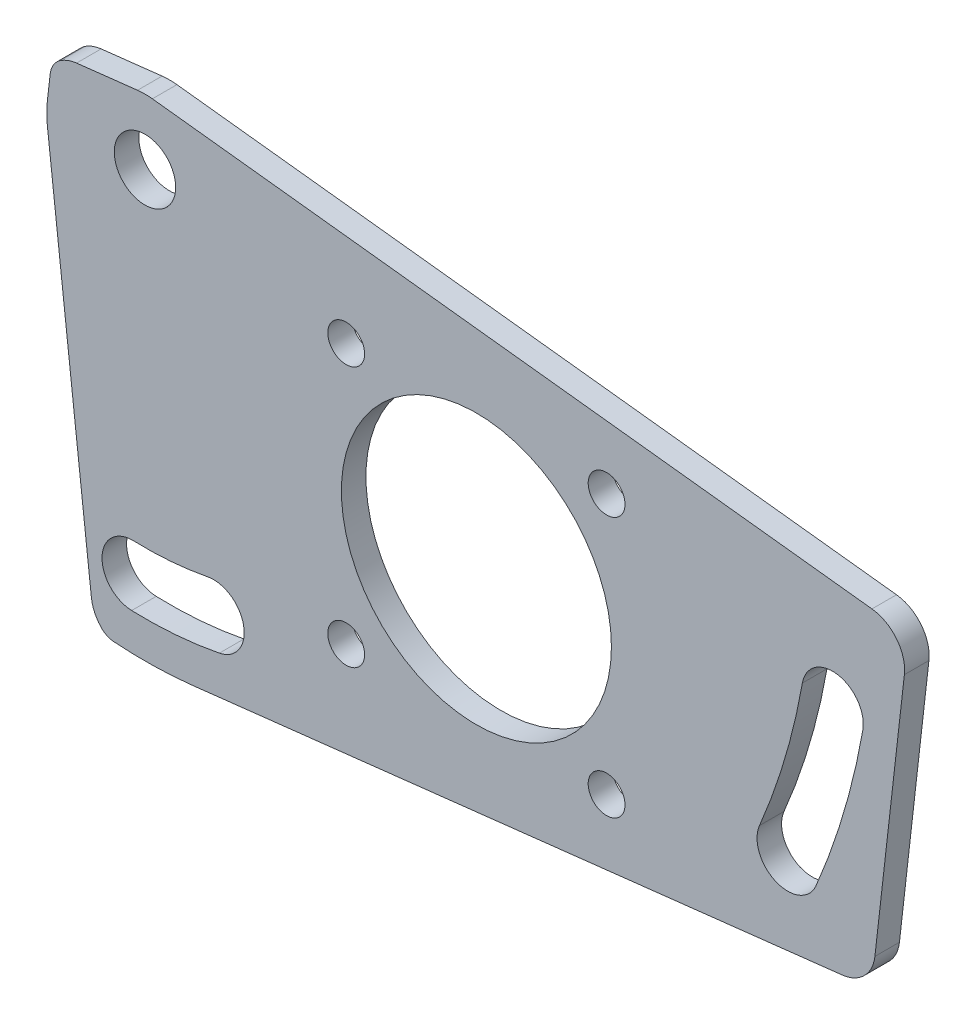
ISO-10303-21;
HEADER;
FILE_DESCRIPTION(('STEP AP214'),'2;1');
FILE_NAME('part.step','',(''),(''),'','','');
FILE_SCHEMA(('AUTOMOTIVE_DESIGN { 1 0 10303 214 1 1 1 1 }'));
ENDSEC;
DATA;
#1=APPLICATION_CONTEXT('core data for automotive mechanical design processes');
#2=APPLICATION_PROTOCOL_DEFINITION('international standard','automotive_design',2000,#1);
#3=PRODUCT_CONTEXT('',#1,'mechanical');
#4=PRODUCT('Part','Part','',(#3));
#5=PRODUCT_RELATED_PRODUCT_CATEGORY('part','',(#4));
#6=PRODUCT_DEFINITION_FORMATION('','',#4);
#7=PRODUCT_DEFINITION_CONTEXT('part definition',#1,'design');
#8=PRODUCT_DEFINITION('design','',#6,#7);
#9=PRODUCT_DEFINITION_SHAPE('','',#8);
#10=(LENGTH_UNIT() NAMED_UNIT(*) SI_UNIT(.MILLI.,.METRE.));
#11=(NAMED_UNIT(*) PLANE_ANGLE_UNIT() SI_UNIT($,.RADIAN.));
#12=(NAMED_UNIT(*) SI_UNIT($,.STERADIAN.) SOLID_ANGLE_UNIT());
#13=UNCERTAINTY_MEASURE_WITH_UNIT(LENGTH_MEASURE(1.E-05),#10,'distance_accuracy_value','');
#14=(GEOMETRIC_REPRESENTATION_CONTEXT(3) GLOBAL_UNCERTAINTY_ASSIGNED_CONTEXT((#13)) GLOBAL_UNIT_ASSIGNED_CONTEXT((#10,
#11,#12)) REPRESENTATION_CONTEXT('',''));
#15=CARTESIAN_POINT('',(0.,0.,0.));
#16=DIRECTION('',(0.,0.,1.));
#17=DIRECTION('',(1.,0.,0.));
#18=AXIS2_PLACEMENT_3D('',#15,#16,#17);
#19=CARTESIAN_POINT('',(-32.,-17.,2.));
#20=DIRECTION('',(0.,0.,-1.));
#21=DIRECTION('',(-1.,0.,0.));
#22=AXIS2_PLACEMENT_3D('',#19,#20,#21);
#23=PLANE('',#22);
#24=CARTESIAN_POINT('',(-10.6066017177982,-10.6066017177982,2.));
#25=DIRECTION('',(0.,0.,1.));
#26=DIRECTION('',(1.,0.,0.));
#27=AXIS2_PLACEMENT_3D('',#24,#25,#26);
#28=CIRCLE('',#27,1.5);
#29=CARTESIAN_POINT('',(-9.10660171779821,-10.6066017177982,2.));
#30=VERTEX_POINT('',#29);
#31=EDGE_CURVE('E327',#30,#30,#28,.T.);
#32=ORIENTED_EDGE('',*,*,#31,.F.);
#33=EDGE_LOOP('',(#32));
#34=FACE_BOUND('',#33,.T.);
#35=CARTESIAN_POINT('',(10.6066017177982,-10.6066017177982,2.));
#36=DIRECTION('',(0.,0.,1.));
#37=DIRECTION('',(1.,0.,0.));
#38=AXIS2_PLACEMENT_3D('',#35,#36,#37);
#39=CIRCLE('',#38,1.5);
#40=CARTESIAN_POINT('',(12.1066017177982,-10.6066017177982,2.));
#41=VERTEX_POINT('',#40);
#42=EDGE_CURVE('E321',#41,#41,#39,.T.);
#43=ORIENTED_EDGE('',*,*,#42,.F.);
#44=EDGE_LOOP('',(#43));
#45=FACE_BOUND('',#44,.T.);
#46=CARTESIAN_POINT('',(10.6066017177982,10.6066017177982,2.));
#47=DIRECTION('',(0.,0.,1.));
#48=DIRECTION('',(1.,0.,0.));
#49=AXIS2_PLACEMENT_3D('',#46,#47,#48);
#50=CIRCLE('',#49,1.5);
#51=CARTESIAN_POINT('',(12.1066017177982,10.6066017177982,2.));
#52=VERTEX_POINT('',#51);
#53=EDGE_CURVE('E314',#52,#52,#50,.T.);
#54=ORIENTED_EDGE('',*,*,#53,.F.);
#55=EDGE_LOOP('',(#54));
#56=FACE_BOUND('',#55,.T.);
#57=CARTESIAN_POINT('',(-10.6066017177982,10.6066017177982,2.));
#58=DIRECTION('',(0.,0.,1.));
#59=DIRECTION('',(1.,0.,0.));
#60=AXIS2_PLACEMENT_3D('',#57,#58,#59);
#61=CIRCLE('',#60,1.5);
#62=CARTESIAN_POINT('',(-9.10660171779822,10.6066017177982,2.));
#63=VERTEX_POINT('',#62);
#64=EDGE_CURVE('E332',#63,#63,#61,.T.);
#65=ORIENTED_EDGE('',*,*,#64,.F.);
#66=EDGE_LOOP('',(#65));
#67=FACE_BOUND('',#66,.T.);
#68=CARTESIAN_POINT('',(25.3610512395109,-7.55928093476605,2.));
#69=DIRECTION('',(0.,0.,1.));
#70=DIRECTION('',(1.,0.,0.));
#71=AXIS2_PLACEMENT_3D('',#68,#69,#70);
#72=CIRCLE('',#71,2.50000000000001);
#73=CARTESIAN_POINT('',(23.0597891058798,-6.58245311354288,2.));
#74=VERTEX_POINT('',#73);
#75=CARTESIAN_POINT('',(27.662313373142,-8.53610875598923,2.));
#76=VERTEX_POINT('',#75);
#77=EDGE_CURVE('E369',#74,#76,#72,.T.);
#78=ORIENTED_EDGE('',*,*,#77,.F.);
#79=CARTESIAN_POINT('',(-27.,14.6666666666667,2.));
#80=DIRECTION('',(0.,0.,-1.));
#81=DIRECTION('',(1.,0.,0.));
#82=AXIS2_PLACEMENT_3D('',#79,#80,#81);
#83=CIRCLE('',#82,54.382971385893);
#84=CARTESIAN_POINT('',(26.5567718526685,5.22316278939351,2.));
#85=VERTEX_POINT('',#84);
#86=EDGE_CURVE('E377',#85,#74,#83,.T.);
#87=ORIENTED_EDGE('',*,*,#86,.F.);
#88=CARTESIAN_POINT('',(29.018791235199,4.78904234522618,2.));
#89=DIRECTION('',(0.,0.,1.));
#90=DIRECTION('',(1.,0.,0.));
#91=AXIS2_PLACEMENT_3D('',#88,#89,#90);
#92=CIRCLE('',#91,2.50000000000001);
#93=CARTESIAN_POINT('',(31.4808106177295,4.35492190105882,2.));
#94=VERTEX_POINT('',#93);
#95=EDGE_CURVE('E374',#94,#85,#92,.T.);
#96=ORIENTED_EDGE('',*,*,#95,.F.);
#97=CARTESIAN_POINT('',(-27.,14.6666666666667,2.));
#98=DIRECTION('',(0.,0.,1.));
#99=DIRECTION('',(1.,0.,0.));
#100=AXIS2_PLACEMENT_3D('',#97,#98,#99);
#101=CIRCLE('',#100,59.382971385893);
#102=EDGE_CURVE('E371',#76,#94,#101,.T.);
#103=ORIENTED_EDGE('',*,*,#102,.F.);
#104=EDGE_LOOP('',(#78,#87,#96,#103));
#105=FACE_BOUND('',#104,.T.);
#106=DIRECTION('',(0.113203213767907,-0.993571855676587,0.));
#107=VECTOR('',#106,1.);
#108=CARTESIAN_POINT('',(-34.9485748454127,13.7610409565234,2.));
#109=LINE('',#108,#107);
#110=CARTESIAN_POINT('',(-34.9485748454127,13.7610409565234,2.));
#111=VERTEX_POINT('',#110);
#112=CARTESIAN_POINT('',(-31.363806409429,-17.7020678065685,2.));
#113=VERTEX_POINT('',#112);
#114=EDGE_CURVE('E210',#111,#113,#109,.T.);
#115=ORIENTED_EDGE('',*,*,#114,.T.);
#116=CARTESIAN_POINT('',(-28.3830908423992,-17.3624581652648,2.));
#117=DIRECTION('',(0.,0.,1.));
#118=DIRECTION('',(1.,0.,0.));
#119=AXIS2_PLACEMENT_3D('',#116,#117,#118);
#120=CIRCLE('',#119,3.);
#121=CARTESIAN_POINT('',(-30.5561611805625,-19.4307340911013,2.));
#122=VERTEX_POINT('',#121);
#123=EDGE_CURVE('E49',#113,#122,#120,.T.);
#124=ORIENTED_EDGE('',*,*,#123,.T.);
#125=CARTESIAN_POINT('',(-29.4380048173965,-18.3664998384669,2.));
#126=DIRECTION('',(0.,0.,1.));
#127=DIRECTION('',(1.,0.,0.));
#128=AXIS2_PLACEMENT_3D('',#125,#126,#127);
#129=CIRCLE('',#128,1.543654170133);
#130=CARTESIAN_POINT('',(-29.5516248060244,-19.9059668550519,2.));
#131=VERTEX_POINT('',#130);
#132=EDGE_CURVE('E201',#122,#131,#129,.T.);
#133=ORIENTED_EDGE('',*,*,#132,.T.);
#134=CARTESIAN_POINT('',(-27.,14.6666666666667,2.));
#135=DIRECTION('',(0.,0.,1.));
#136=DIRECTION('',(1.,0.,0.));
#137=AXIS2_PLACEMENT_3D('',#134,#135,#136);
#138=CIRCLE('',#137,34.6666666666667);
#139=CARTESIAN_POINT('',(-23.0756219227126,-19.777157663455,2.));
#140=VERTEX_POINT('',#139);
#141=EDGE_CURVE('E205',#131,#140,#138,.T.);
#142=ORIENTED_EDGE('',*,*,#141,.T.);
#143=DIRECTION('',(0.993571855676587,0.113203213767907,0.));
#144=VECTOR('',#143,1.);
#145=CARTESIAN_POINT('',(-23.0756219227126,-19.777157663455,2.));
#146=LINE('',#145,#144);
#147=CARTESIAN_POINT('',(29.8232528052238,-13.750092192855,2.));
#148=VERTEX_POINT('',#147);
#149=EDGE_CURVE('E217',#140,#148,#146,.T.);
#150=ORIENTED_EDGE('',*,*,#149,.T.);
#151=CARTESIAN_POINT('',(29.4836431639201,-10.7693766258253,2.));
#152=DIRECTION('',(0.,0.,1.));
#153=DIRECTION('',(1.,0.,0.));
#154=AXIS2_PLACEMENT_3D('',#151,#152,#153);
#155=CIRCLE('',#154,3.);
#156=CARTESIAN_POINT('',(32.4643587309499,-11.108986267129,2.));
#157=VERTEX_POINT('',#156);
#158=EDGE_CURVE('E220',#148,#157,#155,.T.);
#159=ORIENTED_EDGE('',*,*,#158,.T.);
#160=DIRECTION('',(0.113203213767907,0.993571855676587,0.));
#161=VECTOR('',#160,1.);
#162=CARTESIAN_POINT('',(32.4643587309499,-11.108986267129,2.));
#163=LINE('',#162,#161);
#164=CARTESIAN_POINT('',(34.8655958840735,9.96640174296845,2.));
#165=VERTEX_POINT('',#164);
#166=EDGE_CURVE('E223',#157,#165,#163,.T.);
#167=ORIENTED_EDGE('',*,*,#166,.T.);
#168=CARTESIAN_POINT('',(31.8848803170438,10.3060113842722,2.));
#169=DIRECTION('',(0.,0.,1.));
#170=DIRECTION('',(1.,0.,0.));
#171=AXIS2_PLACEMENT_3D('',#168,#169,#170);
#172=CIRCLE('',#171,3.);
#173=CARTESIAN_POINT('',(32.2244899583475,13.2867269513019,2.));
#174=VERTEX_POINT('',#173);
#175=EDGE_CURVE('E226',#165,#174,#172,.T.);
#176=ORIENTED_EDGE('',*,*,#175,.T.);
#177=DIRECTION('',(-0.993571855676587,0.113203213767907,0.));
#178=VECTOR('',#177,1.);
#179=CARTESIAN_POINT('',(32.2244899583475,13.2867269513019,2.));
#180=LINE('',#179,#178);
#181=CARTESIAN_POINT('',(-26.3962495265712,19.9657165636085,2.));
#182=VERTEX_POINT('',#181);
#183=EDGE_CURVE('E229',#174,#182,#180,.T.);
#184=ORIENTED_EDGE('',*,*,#183,.T.);
#185=CARTESIAN_POINT('',(-27.,14.6666666666667,2.));
#186=DIRECTION('',(0.,0.,1.));
#187=DIRECTION('',(1.,0.,0.));
#188=AXIS2_PLACEMENT_3D('',#185,#186,#187);
#189=CIRCLE('',#188,5.33333333333333);
#190=CARTESIAN_POINT('',(-27.6037504734288,19.9657165636085,2.));
#191=VERTEX_POINT('',#190);
#192=EDGE_CURVE('E232',#182,#191,#189,.T.);
#193=ORIENTED_EDGE('',*,*,#192,.T.);
#194=DIRECTION('',(-0.993571855676587,-0.113203213767909,0.));
#195=VECTOR('',#194,1.);
#196=CARTESIAN_POINT('',(-27.6037504734288,19.9657165636085,2.));
#197=LINE('',#196,#195);
#198=CARTESIAN_POINT('',(-32.5716097518118,19.3997004947689,2.));
#199=VERTEX_POINT('',#198);
#200=EDGE_CURVE('E235',#191,#199,#197,.T.);
#201=ORIENTED_EDGE('',*,*,#200,.T.);
#202=CARTESIAN_POINT('',(-32.2320001105081,16.4189849277392,2.));
#203=DIRECTION('',(0.,0.,1.));
#204=DIRECTION('',(1.,0.,0.));
#205=AXIS2_PLACEMENT_3D('',#202,#203,#204);
#206=CIRCLE('',#205,3.);
#207=CARTESIAN_POINT('',(-33.8698794125308,18.932419110686,2.));
#208=VERTEX_POINT('',#207);
#209=EDGE_CURVE('E238',#199,#208,#206,.T.);
#210=ORIENTED_EDGE('',*,*,#209,.T.);
#211=CARTESIAN_POINT('',(-32.8291820747344,17.3354001730336,2.));
#212=DIRECTION('',(0.,0.,1.));
#213=DIRECTION('',(1.,0.,0.));
#214=AXIS2_PLACEMENT_3D('',#211,#212,#213);
#215=CIRCLE('',#214,1.9061795393186);
#216=CARTESIAN_POINT('',(-34.7231084168679,17.5511858229031,2.));
#217=VERTEX_POINT('',#216);
#218=EDGE_CURVE('E241',#208,#217,#215,.T.);
#219=ORIENTED_EDGE('',*,*,#218,.T.);
#220=DIRECTION('',(-0.113203213767902,-0.993571855676588,0.));
#221=VECTOR('',#220,1.);
#222=CARTESIAN_POINT('',(-34.7231084168679,17.5511858229031,2.));
#223=LINE('',#222,#221);
#224=CARTESIAN_POINT('',(-34.9485748454127,15.5722923768099,2.));
#225=VERTEX_POINT('',#224);
#226=EDGE_CURVE('E244',#217,#225,#223,.T.);
#227=ORIENTED_EDGE('',*,*,#226,.T.);
#228=CARTESIAN_POINT('',(-27.,14.6666666666667,2.));
#229=DIRECTION('',(0.,0.,1.));
#230=DIRECTION('',(1.,0.,0.));
#231=AXIS2_PLACEMENT_3D('',#228,#229,#230);
#232=CIRCLE('',#231,8.);
#233=EDGE_CURVE('E247',#225,#111,#232,.T.);
#234=ORIENTED_EDGE('',*,*,#233,.T.);
#235=EDGE_LOOP('',(#115,#124,#133,#142,#150,#159,#167,#176,#184,#193,#201,#210,#219,#227,#234));
#236=FACE_BOUND('',#235,.T.);
#237=CARTESIAN_POINT('',(0.,0.,2.));
#238=DIRECTION('',(0.,0.,1.));
#239=DIRECTION('',(1.,0.,0.));
#240=AXIS2_PLACEMENT_3D('',#237,#238,#239);
#241=CIRCLE('',#240,11.);
#242=CARTESIAN_POINT('',(11.,0.,2.));
#243=VERTEX_POINT('',#242);
#244=EDGE_CURVE('E12',#243,#243,#241,.T.);
#245=ORIENTED_EDGE('',*,*,#244,.F.);
#246=EDGE_LOOP('',(#245));
#247=FACE_BOUND('',#246,.T.);
#248=CARTESIAN_POINT('',(-27.,14.6666666666667,2.));
#249=DIRECTION('',(0.,0.,1.));
#250=DIRECTION('',(1.,0.,0.));
#251=AXIS2_PLACEMENT_3D('',#248,#249,#250);
#252=CIRCLE('',#251,2.49999999999999);
#253=CARTESIAN_POINT('',(-24.5,14.6666666666667,2.));
#254=VERTEX_POINT('',#253);
#255=EDGE_CURVE('E400',#254,#254,#252,.T.);
#256=ORIENTED_EDGE('',*,*,#255,.F.);
#257=EDGE_LOOP('',(#256));
#258=FACE_BOUND('',#257,.T.);
#259=CARTESIAN_POINT('',(-28.,-14.482852101993,2.));
#260=DIRECTION('',(0.,0.,1.));
#261=DIRECTION('',(1.,0.,0.));
#262=AXIS2_PLACEMENT_3D('',#259,#260,#261);
#263=CIRCLE('',#262,2.5);
#264=CARTESIAN_POINT('',(-27.9142857142857,-11.9843219218222,2.));
#265=VERTEX_POINT('',#264);
#266=CARTESIAN_POINT('',(-28.0857142857143,-16.9813822821639,2.));
#267=VERTEX_POINT('',#266);
#268=EDGE_CURVE('E338',#265,#267,#263,.T.);
#269=ORIENTED_EDGE('',*,*,#268,.F.);
#270=CARTESIAN_POINT('',(-27.,14.6666666666667,2.));
#271=DIRECTION('',(0.,0.,-1.));
#272=DIRECTION('',(1.,0.,0.));
#273=AXIS2_PLACEMENT_3D('',#270,#271,#272);
#274=CIRCLE('',#273,26.6666666666667);
#275=CARTESIAN_POINT('',(-21.8956846483741,-11.5069283462899,2.));
#276=VERTEX_POINT('',#275);
#277=EDGE_CURVE('E346',#276,#265,#274,.T.);
#278=ORIENTED_EDGE('',*,*,#277,.F.);
#279=CARTESIAN_POINT('',(-21.4171550841591,-13.9607028787546,2.));
#280=DIRECTION('',(0.,0.,1.));
#281=DIRECTION('',(1.,0.,0.));
#282=AXIS2_PLACEMENT_3D('',#279,#280,#281);
#283=CIRCLE('',#282,2.5);
#284=CARTESIAN_POINT('',(-20.9386255199442,-16.4144774112193,2.));
#285=VERTEX_POINT('',#284);
#286=EDGE_CURVE('E343',#285,#276,#283,.T.);
#287=ORIENTED_EDGE('',*,*,#286,.F.);
#288=CARTESIAN_POINT('',(-27.,14.6666666666667,2.));
#289=DIRECTION('',(0.,0.,1.));
#290=DIRECTION('',(1.,0.,0.));
#291=AXIS2_PLACEMENT_3D('',#288,#289,#290);
#292=CIRCLE('',#291,31.6666666666667);
#293=EDGE_CURVE('E340',#267,#285,#292,.T.);
#294=ORIENTED_EDGE('',*,*,#293,.F.);
#295=EDGE_LOOP('',(#269,#278,#287,#294));
#296=FACE_BOUND('',#295,.T.);
#297=ADVANCED_FACE('F34',(#34,#45,#56,#67,#105,#236,#247,#258,#296),#23,.F.);
#298=CARTESIAN_POINT('',(-32.,-17.,0.));
#299=DIRECTION('',(0.,0.,-1.));
#300=DIRECTION('',(-1.,0.,0.));
#301=AXIS2_PLACEMENT_3D('',#298,#299,#300);
#302=PLANE('',#301);
#303=CARTESIAN_POINT('',(-28.3830908423992,-17.3624581652648,0.));
#304=DIRECTION('',(0.,0.,1.));
#305=DIRECTION('',(1.,0.,0.));
#306=AXIS2_PLACEMENT_3D('',#303,#304,#305);
#307=CIRCLE('',#306,3.);
#308=CARTESIAN_POINT('',(-31.363806409429,-17.7020678065685,0.));
#309=VERTEX_POINT('',#308);
#310=CARTESIAN_POINT('',(-30.5561611805625,-19.4307340911013,0.));
#311=VERTEX_POINT('',#310);
#312=EDGE_CURVE('E192',#309,#311,#307,.T.);
#313=ORIENTED_EDGE('',*,*,#312,.F.);
#314=DIRECTION('',(0.113203213767907,-0.993571855676587,0.));
#315=VECTOR('',#314,1.);
#316=CARTESIAN_POINT('',(-34.9485748454127,13.7610409565234,0.));
#317=LINE('',#316,#315);
#318=CARTESIAN_POINT('',(-34.9485748454127,13.7610409565234,0.));
#319=VERTEX_POINT('',#318);
#320=EDGE_CURVE('E211',#319,#309,#317,.T.);
#321=ORIENTED_EDGE('',*,*,#320,.F.);
#322=CARTESIAN_POINT('',(-27.,14.6666666666667,0.));
#323=DIRECTION('',(0.,0.,1.));
#324=DIRECTION('',(1.,0.,0.));
#325=AXIS2_PLACEMENT_3D('',#322,#323,#324);
#326=CIRCLE('',#325,8.);
#327=CARTESIAN_POINT('',(-34.9485748454127,15.5722923768099,0.));
#328=VERTEX_POINT('',#327);
#329=EDGE_CURVE('E213',#328,#319,#326,.T.);
#330=ORIENTED_EDGE('',*,*,#329,.F.);
#331=DIRECTION('',(-0.113203213767902,-0.993571855676588,0.));
#332=VECTOR('',#331,1.);
#333=CARTESIAN_POINT('',(-34.7231084168679,17.5511858229031,0.));
#334=LINE('',#333,#332);
#335=CARTESIAN_POINT('',(-34.7231084168679,17.5511858229031,0.));
#336=VERTEX_POINT('',#335);
#337=EDGE_CURVE('E282',#336,#328,#334,.T.);
#338=ORIENTED_EDGE('',*,*,#337,.F.);
#339=CARTESIAN_POINT('',(-32.8291820747344,17.3354001730336,0.));
#340=DIRECTION('',(0.,0.,1.));
#341=DIRECTION('',(1.,0.,0.));
#342=AXIS2_PLACEMENT_3D('',#339,#340,#341);
#343=CIRCLE('',#342,1.9061795393186);
#344=CARTESIAN_POINT('',(-33.8698794125308,18.932419110686,0.));
#345=VERTEX_POINT('',#344);
#346=EDGE_CURVE('E279',#345,#336,#343,.T.);
#347=ORIENTED_EDGE('',*,*,#346,.F.);
#348=CARTESIAN_POINT('',(-32.2320001105081,16.4189849277392,0.));
#349=DIRECTION('',(0.,0.,1.));
#350=DIRECTION('',(1.,0.,0.));
#351=AXIS2_PLACEMENT_3D('',#348,#349,#350);
#352=CIRCLE('',#351,3.);
#353=CARTESIAN_POINT('',(-32.5716097518118,19.3997004947689,0.));
#354=VERTEX_POINT('',#353);
#355=EDGE_CURVE('E276',#354,#345,#352,.T.);
#356=ORIENTED_EDGE('',*,*,#355,.F.);
#357=DIRECTION('',(-0.993571855676587,-0.113203213767909,0.));
#358=VECTOR('',#357,1.);
#359=CARTESIAN_POINT('',(-27.6037504734288,19.9657165636085,0.));
#360=LINE('',#359,#358);
#361=CARTESIAN_POINT('',(-27.6037504734288,19.9657165636085,0.));
#362=VERTEX_POINT('',#361);
#363=EDGE_CURVE('E273',#362,#354,#360,.T.);
#364=ORIENTED_EDGE('',*,*,#363,.F.);
#365=CARTESIAN_POINT('',(-27.,14.6666666666667,0.));
#366=DIRECTION('',(0.,0.,1.));
#367=DIRECTION('',(1.,0.,0.));
#368=AXIS2_PLACEMENT_3D('',#365,#366,#367);
#369=CIRCLE('',#368,5.33333333333333);
#370=CARTESIAN_POINT('',(-26.3962495265712,19.9657165636085,0.));
#371=VERTEX_POINT('',#370);
#372=EDGE_CURVE('E271',#371,#362,#369,.T.);
#373=ORIENTED_EDGE('',*,*,#372,.F.);
#374=DIRECTION('',(-0.993571855676587,0.113203213767907,0.));
#375=VECTOR('',#374,1.);
#376=CARTESIAN_POINT('',(32.2244899583475,13.2867269513019,0.));
#377=LINE('',#376,#375);
#378=CARTESIAN_POINT('',(32.2244899583475,13.2867269513019,0.));
#379=VERTEX_POINT('',#378);
#380=EDGE_CURVE('E268',#379,#371,#377,.T.);
#381=ORIENTED_EDGE('',*,*,#380,.F.);
#382=CARTESIAN_POINT('',(31.8848803170438,10.3060113842722,0.));
#383=DIRECTION('',(0.,0.,1.));
#384=DIRECTION('',(1.,0.,0.));
#385=AXIS2_PLACEMENT_3D('',#382,#383,#384);
#386=CIRCLE('',#385,3.);
#387=CARTESIAN_POINT('',(34.8655958840735,9.96640174296845,0.));
#388=VERTEX_POINT('',#387);
#389=EDGE_CURVE('E265',#388,#379,#386,.T.);
#390=ORIENTED_EDGE('',*,*,#389,.F.);
#391=DIRECTION('',(0.113203213767907,0.993571855676587,0.));
#392=VECTOR('',#391,1.);
#393=CARTESIAN_POINT('',(32.4643587309499,-11.108986267129,0.));
#394=LINE('',#393,#392);
#395=CARTESIAN_POINT('',(32.4643587309499,-11.108986267129,0.));
#396=VERTEX_POINT('',#395);
#397=EDGE_CURVE('E262',#396,#388,#394,.T.);
#398=ORIENTED_EDGE('',*,*,#397,.F.);
#399=CARTESIAN_POINT('',(29.4836431639201,-10.7693766258253,0.));
#400=DIRECTION('',(0.,0.,1.));
#401=DIRECTION('',(1.,0.,0.));
#402=AXIS2_PLACEMENT_3D('',#399,#400,#401);
#403=CIRCLE('',#402,3.);
#404=CARTESIAN_POINT('',(29.8232528052238,-13.750092192855,0.));
#405=VERTEX_POINT('',#404);
#406=EDGE_CURVE('E259',#405,#396,#403,.T.);
#407=ORIENTED_EDGE('',*,*,#406,.F.);
#408=DIRECTION('',(0.993571855676587,0.113203213767907,0.));
#409=VECTOR('',#408,1.);
#410=CARTESIAN_POINT('',(-23.0756219227126,-19.777157663455,0.));
#411=LINE('',#410,#409);
#412=CARTESIAN_POINT('',(-23.0756219227126,-19.777157663455,0.));
#413=VERTEX_POINT('',#412);
#414=EDGE_CURVE('E256',#413,#405,#411,.T.);
#415=ORIENTED_EDGE('',*,*,#414,.F.);
#416=CARTESIAN_POINT('',(-27.,14.6666666666667,0.));
#417=DIRECTION('',(0.,0.,1.));
#418=DIRECTION('',(1.,0.,0.));
#419=AXIS2_PLACEMENT_3D('',#416,#417,#418);
#420=CIRCLE('',#419,34.6666666666667);
#421=CARTESIAN_POINT('',(-29.5516248060244,-19.9059668550519,0.));
#422=VERTEX_POINT('',#421);
#423=EDGE_CURVE('E254',#422,#413,#420,.T.);
#424=ORIENTED_EDGE('',*,*,#423,.F.);
#425=CARTESIAN_POINT('',(-29.4380048173965,-18.3664998384669,0.));
#426=DIRECTION('',(0.,0.,1.));
#427=DIRECTION('',(1.,0.,0.));
#428=AXIS2_PLACEMENT_3D('',#425,#426,#427);
#429=CIRCLE('',#428,1.543654170133);
#430=EDGE_CURVE('E252',#311,#422,#429,.T.);
#431=ORIENTED_EDGE('',*,*,#430,.F.);
#432=EDGE_LOOP('',(#313,#321,#330,#338,#347,#356,#364,#373,#381,#390,#398,#407,#415,#424,#431));
#433=FACE_BOUND('',#432,.T.);
#434=CARTESIAN_POINT('',(-10.6066017177982,-10.6066017177982,0.));
#435=DIRECTION('',(0.,0.,1.));
#436=DIRECTION('',(1.,0.,0.));
#437=AXIS2_PLACEMENT_3D('',#434,#435,#436);
#438=CIRCLE('',#437,1.5);
#439=CARTESIAN_POINT('',(-9.10660171779821,-10.6066017177982,0.));
#440=VERTEX_POINT('',#439);
#441=EDGE_CURVE('E196',#440,#440,#438,.T.);
#442=ORIENTED_EDGE('',*,*,#441,.T.);
#443=EDGE_LOOP('',(#442));
#444=FACE_BOUND('',#443,.T.);
#445=CARTESIAN_POINT('',(10.6066017177982,-10.6066017177982,0.));
#446=DIRECTION('',(0.,0.,1.));
#447=DIRECTION('',(1.,0.,0.));
#448=AXIS2_PLACEMENT_3D('',#445,#446,#447);
#449=CIRCLE('',#448,1.5);
#450=CARTESIAN_POINT('',(12.1066017177982,-10.6066017177982,0.));
#451=VERTEX_POINT('',#450);
#452=EDGE_CURVE('E324',#451,#451,#449,.T.);
#453=ORIENTED_EDGE('',*,*,#452,.T.);
#454=EDGE_LOOP('',(#453));
#455=FACE_BOUND('',#454,.T.);
#456=CARTESIAN_POINT('',(10.6066017177982,10.6066017177982,0.));
#457=DIRECTION('',(0.,0.,1.));
#458=DIRECTION('',(1.,0.,0.));
#459=AXIS2_PLACEMENT_3D('',#456,#457,#458);
#460=CIRCLE('',#459,1.5);
#461=CARTESIAN_POINT('',(12.1066017177982,10.6066017177982,0.));
#462=VERTEX_POINT('',#461);
#463=EDGE_CURVE('E318',#462,#462,#460,.T.);
#464=ORIENTED_EDGE('',*,*,#463,.T.);
#465=EDGE_LOOP('',(#464));
#466=FACE_BOUND('',#465,.T.);
#467=CARTESIAN_POINT('',(-10.6066017177982,10.6066017177982,0.));
#468=DIRECTION('',(0.,0.,1.));
#469=DIRECTION('',(1.,0.,0.));
#470=AXIS2_PLACEMENT_3D('',#467,#468,#469);
#471=CIRCLE('',#470,1.5);
#472=CARTESIAN_POINT('',(-9.10660171779822,10.6066017177982,0.));
#473=VERTEX_POINT('',#472);
#474=EDGE_CURVE('E317',#473,#473,#471,.T.);
#475=ORIENTED_EDGE('',*,*,#474,.T.);
#476=EDGE_LOOP('',(#475));
#477=FACE_BOUND('',#476,.T.);
#478=CARTESIAN_POINT('',(0.,0.,0.));
#479=DIRECTION('',(0.,0.,1.));
#480=DIRECTION('',(1.,0.,0.));
#481=AXIS2_PLACEMENT_3D('',#478,#479,#480);
#482=CIRCLE('',#481,11.);
#483=CARTESIAN_POINT('',(11.,0.,0.));
#484=VERTEX_POINT('',#483);
#485=EDGE_CURVE('E38',#484,#484,#482,.T.);
#486=ORIENTED_EDGE('',*,*,#485,.T.);
#487=EDGE_LOOP('',(#486));
#488=FACE_BOUND('',#487,.T.);
#489=CARTESIAN_POINT('',(-27.,14.6666666666667,0.));
#490=DIRECTION('',(0.,0.,1.));
#491=DIRECTION('',(1.,0.,0.));
#492=AXIS2_PLACEMENT_3D('',#489,#490,#491);
#493=CIRCLE('',#492,2.49999999999999);
#494=CARTESIAN_POINT('',(-24.5,14.6666666666667,0.));
#495=VERTEX_POINT('',#494);
#496=EDGE_CURVE('E399',#495,#495,#493,.T.);
#497=ORIENTED_EDGE('',*,*,#496,.T.);
#498=EDGE_LOOP('',(#497));
#499=FACE_BOUND('',#498,.T.);
#500=CARTESIAN_POINT('',(-27.,14.6666666666667,0.));
#501=DIRECTION('',(0.,0.,-1.));
#502=DIRECTION('',(1.,0.,0.));
#503=AXIS2_PLACEMENT_3D('',#500,#501,#502);
#504=CIRCLE('',#503,54.382971385893);
#505=CARTESIAN_POINT('',(26.5567718526685,5.22316278939351,0.));
#506=VERTEX_POINT('',#505);
#507=CARTESIAN_POINT('',(23.0597891058798,-6.58245311354288,0.));
#508=VERTEX_POINT('',#507);
#509=EDGE_CURVE('E372',#506,#508,#504,.T.);
#510=ORIENTED_EDGE('',*,*,#509,.T.);
#511=CARTESIAN_POINT('',(25.3610512395109,-7.55928093476605,0.));
#512=DIRECTION('',(0.,0.,1.));
#513=DIRECTION('',(1.,0.,0.));
#514=AXIS2_PLACEMENT_3D('',#511,#512,#513);
#515=CIRCLE('',#514,2.50000000000001);
#516=CARTESIAN_POINT('',(27.662313373142,-8.53610875598923,0.));
#517=VERTEX_POINT('',#516);
#518=EDGE_CURVE('E368',#508,#517,#515,.T.);
#519=ORIENTED_EDGE('',*,*,#518,.T.);
#520=CARTESIAN_POINT('',(-27.,14.6666666666667,0.));
#521=DIRECTION('',(0.,0.,1.));
#522=DIRECTION('',(1.,0.,0.));
#523=AXIS2_PLACEMENT_3D('',#520,#521,#522);
#524=CIRCLE('',#523,59.382971385893);
#525=CARTESIAN_POINT('',(31.4808106177295,4.35492190105882,0.));
#526=VERTEX_POINT('',#525);
#527=EDGE_CURVE('E382',#517,#526,#524,.T.);
#528=ORIENTED_EDGE('',*,*,#527,.T.);
#529=CARTESIAN_POINT('',(29.018791235199,4.78904234522618,0.));
#530=DIRECTION('',(0.,0.,1.));
#531=DIRECTION('',(1.,0.,0.));
#532=AXIS2_PLACEMENT_3D('',#529,#530,#531);
#533=CIRCLE('',#532,2.50000000000001);
#534=EDGE_CURVE('E385',#526,#506,#533,.T.);
#535=ORIENTED_EDGE('',*,*,#534,.T.);
#536=EDGE_LOOP('',(#510,#519,#528,#535));
#537=FACE_BOUND('',#536,.T.);
#538=CARTESIAN_POINT('',(-27.,14.6666666666667,0.));
#539=DIRECTION('',(0.,0.,-1.));
#540=DIRECTION('',(1.,0.,0.));
#541=AXIS2_PLACEMENT_3D('',#538,#539,#540);
#542=CIRCLE('',#541,26.6666666666667);
#543=CARTESIAN_POINT('',(-21.8956846483741,-11.5069283462899,0.));
#544=VERTEX_POINT('',#543);
#545=CARTESIAN_POINT('',(-27.9142857142857,-11.9843219218222,0.));
#546=VERTEX_POINT('',#545);
#547=EDGE_CURVE('E341',#544,#546,#542,.T.);
#548=ORIENTED_EDGE('',*,*,#547,.T.);
#549=CARTESIAN_POINT('',(-28.,-14.482852101993,0.));
#550=DIRECTION('',(0.,0.,1.));
#551=DIRECTION('',(1.,0.,0.));
#552=AXIS2_PLACEMENT_3D('',#549,#550,#551);
#553=CIRCLE('',#552,2.5);
#554=CARTESIAN_POINT('',(-28.0857142857143,-16.9813822821639,0.));
#555=VERTEX_POINT('',#554);
#556=EDGE_CURVE('E335',#546,#555,#553,.T.);
#557=ORIENTED_EDGE('',*,*,#556,.T.);
#558=CARTESIAN_POINT('',(-27.,14.6666666666667,0.));
#559=DIRECTION('',(0.,0.,1.));
#560=DIRECTION('',(1.,0.,0.));
#561=AXIS2_PLACEMENT_3D('',#558,#559,#560);
#562=CIRCLE('',#561,31.6666666666667);
#563=CARTESIAN_POINT('',(-20.9386255199442,-16.4144774112193,0.));
#564=VERTEX_POINT('',#563);
#565=EDGE_CURVE('E351',#555,#564,#562,.T.);
#566=ORIENTED_EDGE('',*,*,#565,.T.);
#567=CARTESIAN_POINT('',(-21.4171550841591,-13.9607028787546,0.));
#568=DIRECTION('',(0.,0.,1.));
#569=DIRECTION('',(1.,0.,0.));
#570=AXIS2_PLACEMENT_3D('',#567,#568,#569);
#571=CIRCLE('',#570,2.5);
#572=EDGE_CURVE('E354',#564,#544,#571,.T.);
#573=ORIENTED_EDGE('',*,*,#572,.T.);
#574=EDGE_LOOP('',(#548,#557,#566,#573));
#575=FACE_BOUND('',#574,.T.);
#576=ADVANCED_FACE('F36',(#433,#444,#455,#466,#477,#488,#499,#537,#575),#302,.T.);
#577=CARTESIAN_POINT('',(0.,0.,2.));
#578=DIRECTION('',(0.,0.,-1.));
#579=DIRECTION('',(-1.,0.,0.));
#580=AXIS2_PLACEMENT_3D('',#577,#578,#579);
#581=CYLINDRICAL_SURFACE('',#580,11.);
#582=ORIENTED_EDGE('',*,*,#244,.T.);
#583=EDGE_LOOP('',(#582));
#584=FACE_BOUND('',#583,.T.);
#585=ORIENTED_EDGE('',*,*,#485,.F.);
#586=EDGE_LOOP('',(#585));
#587=FACE_BOUND('',#586,.T.);
#588=ADVANCED_FACE('F411',(#584,#587),#581,.F.);
#589=CARTESIAN_POINT('',(-27.,14.6666666666667,2.));
#590=DIRECTION('',(0.,0.,-1.));
#591=DIRECTION('',(-1.,0.,0.));
#592=AXIS2_PLACEMENT_3D('',#589,#590,#591);
#593=CYLINDRICAL_SURFACE('',#592,2.49999999999999);
#594=ORIENTED_EDGE('',*,*,#255,.T.);
#595=EDGE_LOOP('',(#594));
#596=FACE_BOUND('',#595,.T.);
#597=ORIENTED_EDGE('',*,*,#496,.F.);
#598=EDGE_LOOP('',(#597));
#599=FACE_BOUND('',#598,.T.);
#600=ADVANCED_FACE('F408',(#596,#599),#593,.F.);
#601=CARTESIAN_POINT('',(25.3610512395109,-7.55928093476605,2.));
#602=DIRECTION('',(0.,0.,-1.));
#603=DIRECTION('',(-1.,0.,0.));
#604=AXIS2_PLACEMENT_3D('',#601,#602,#603);
#605=CYLINDRICAL_SURFACE('',#604,2.50000000000001);
#606=ORIENTED_EDGE('',*,*,#518,.F.);
#607=DIRECTION('',(0.,0.,-1.));
#608=VECTOR('',#607,1.);
#609=CARTESIAN_POINT('',(23.0597891058798,-6.58245311354288,2.));
#610=LINE('',#609,#608);
#611=EDGE_CURVE('E379',#74,#508,#610,.T.);
#612=ORIENTED_EDGE('',*,*,#611,.F.);
#613=ORIENTED_EDGE('',*,*,#77,.T.);
#614=DIRECTION('',(0.,0.,-1.));
#615=VECTOR('',#614,1.);
#616=CARTESIAN_POINT('',(27.662313373142,-8.53610875598923,2.));
#617=LINE('',#616,#615);
#618=EDGE_CURVE('E396',#76,#517,#617,.T.);
#619=ORIENTED_EDGE('',*,*,#618,.T.);
#620=EDGE_LOOP('',(#606,#612,#613,#619));
#621=FACE_BOUND('',#620,.T.);
#622=ADVANCED_FACE('F410',(#621),#605,.F.);
#623=CARTESIAN_POINT('',(-27.,14.6666666666667,2.));
#624=DIRECTION('',(0.,0.,-1.));
#625=DIRECTION('',(-1.,0.,0.));
#626=AXIS2_PLACEMENT_3D('',#623,#624,#625);
#627=CYLINDRICAL_SURFACE('',#626,59.382971385893);
#628=ORIENTED_EDGE('',*,*,#527,.F.);
#629=ORIENTED_EDGE('',*,*,#618,.F.);
#630=ORIENTED_EDGE('',*,*,#102,.T.);
#631=DIRECTION('',(0.,0.,-1.));
#632=VECTOR('',#631,1.);
#633=CARTESIAN_POINT('',(31.4808106177295,4.35492190105882,2.));
#634=LINE('',#633,#632);
#635=EDGE_CURVE('E394',#94,#526,#634,.T.);
#636=ORIENTED_EDGE('',*,*,#635,.T.);
#637=EDGE_LOOP('',(#628,#629,#630,#636));
#638=FACE_BOUND('',#637,.T.);
#639=ADVANCED_FACE('F418',(#638),#627,.F.);
#640=CARTESIAN_POINT('',(29.018791235199,4.78904234522618,2.));
#641=DIRECTION('',(0.,0.,-1.));
#642=DIRECTION('',(-1.,0.,0.));
#643=AXIS2_PLACEMENT_3D('',#640,#641,#642);
#644=CYLINDRICAL_SURFACE('',#643,2.50000000000001);
#645=ORIENTED_EDGE('',*,*,#534,.F.);
#646=ORIENTED_EDGE('',*,*,#635,.F.);
#647=ORIENTED_EDGE('',*,*,#95,.T.);
#648=DIRECTION('',(0.,0.,-1.));
#649=VECTOR('',#648,1.);
#650=CARTESIAN_POINT('',(26.5567718526685,5.22316278939351,2.));
#651=LINE('',#650,#649);
#652=EDGE_CURVE('E392',#85,#506,#651,.T.);
#653=ORIENTED_EDGE('',*,*,#652,.T.);
#654=EDGE_LOOP('',(#645,#646,#647,#653));
#655=FACE_BOUND('',#654,.T.);
#656=ADVANCED_FACE('F451',(#655),#644,.F.);
#657=CARTESIAN_POINT('',(-27.,14.6666666666667,2.));
#658=DIRECTION('',(0.,0.,-1.));
#659=DIRECTION('',(-1.,0.,0.));
#660=AXIS2_PLACEMENT_3D('',#657,#658,#659);
#661=CYLINDRICAL_SURFACE('',#660,54.382971385893);
#662=ORIENTED_EDGE('',*,*,#509,.F.);
#663=ORIENTED_EDGE('',*,*,#652,.F.);
#664=ORIENTED_EDGE('',*,*,#86,.T.);
#665=ORIENTED_EDGE('',*,*,#611,.T.);
#666=EDGE_LOOP('',(#662,#663,#664,#665));
#667=FACE_BOUND('',#666,.T.);
#668=ADVANCED_FACE('F449',(#667),#661,.T.);
#669=CARTESIAN_POINT('',(-28.,-14.482852101993,2.));
#670=DIRECTION('',(0.,0.,-1.));
#671=DIRECTION('',(-1.,0.,0.));
#672=AXIS2_PLACEMENT_3D('',#669,#670,#671);
#673=CYLINDRICAL_SURFACE('',#672,2.5);
#674=ORIENTED_EDGE('',*,*,#556,.F.);
#675=DIRECTION('',(0.,0.,-1.));
#676=VECTOR('',#675,1.);
#677=CARTESIAN_POINT('',(-27.9142857142857,-11.9843219218222,2.));
#678=LINE('',#677,#676);
#679=EDGE_CURVE('E348',#265,#546,#678,.T.);
#680=ORIENTED_EDGE('',*,*,#679,.F.);
#681=ORIENTED_EDGE('',*,*,#268,.T.);
#682=DIRECTION('',(0.,0.,-1.));
#683=VECTOR('',#682,1.);
#684=CARTESIAN_POINT('',(-28.0857142857143,-16.9813822821639,2.));
#685=LINE('',#684,#683);
#686=EDGE_CURVE('E365',#267,#555,#685,.T.);
#687=ORIENTED_EDGE('',*,*,#686,.T.);
#688=EDGE_LOOP('',(#674,#680,#681,#687));
#689=FACE_BOUND('',#688,.T.);
#690=ADVANCED_FACE('F458',(#689),#673,.F.);
#691=CARTESIAN_POINT('',(-27.,14.6666666666667,2.));
#692=DIRECTION('',(0.,0.,-1.));
#693=DIRECTION('',(-1.,0.,0.));
#694=AXIS2_PLACEMENT_3D('',#691,#692,#693);
#695=CYLINDRICAL_SURFACE('',#694,31.6666666666667);
#696=ORIENTED_EDGE('',*,*,#565,.F.);
#697=ORIENTED_EDGE('',*,*,#686,.F.);
#698=ORIENTED_EDGE('',*,*,#293,.T.);
#699=DIRECTION('',(0.,0.,-1.));
#700=VECTOR('',#699,1.);
#701=CARTESIAN_POINT('',(-20.9386255199442,-16.4144774112193,2.));
#702=LINE('',#701,#700);
#703=EDGE_CURVE('E363',#285,#564,#702,.T.);
#704=ORIENTED_EDGE('',*,*,#703,.T.);
#705=EDGE_LOOP('',(#696,#697,#698,#704));
#706=FACE_BOUND('',#705,.T.);
#707=ADVANCED_FACE('F464',(#706),#695,.F.);
#708=CARTESIAN_POINT('',(-21.4171550841591,-13.9607028787546,2.));
#709=DIRECTION('',(0.,0.,-1.));
#710=DIRECTION('',(-1.,0.,0.));
#711=AXIS2_PLACEMENT_3D('',#708,#709,#710);
#712=CYLINDRICAL_SURFACE('',#711,2.5);
#713=ORIENTED_EDGE('',*,*,#572,.F.);
#714=ORIENTED_EDGE('',*,*,#703,.F.);
#715=ORIENTED_EDGE('',*,*,#286,.T.);
#716=DIRECTION('',(0.,0.,-1.));
#717=VECTOR('',#716,1.);
#718=CARTESIAN_POINT('',(-21.8956846483741,-11.5069283462899,2.));
#719=LINE('',#718,#717);
#720=EDGE_CURVE('E361',#276,#544,#719,.T.);
#721=ORIENTED_EDGE('',*,*,#720,.T.);
#722=EDGE_LOOP('',(#713,#714,#715,#721));
#723=FACE_BOUND('',#722,.T.);
#724=ADVANCED_FACE('F468',(#723),#712,.F.);
#725=CARTESIAN_POINT('',(-27.,14.6666666666667,2.));
#726=DIRECTION('',(0.,0.,-1.));
#727=DIRECTION('',(-1.,0.,0.));
#728=AXIS2_PLACEMENT_3D('',#725,#726,#727);
#729=CYLINDRICAL_SURFACE('',#728,26.6666666666667);
#730=ORIENTED_EDGE('',*,*,#547,.F.);
#731=ORIENTED_EDGE('',*,*,#720,.F.);
#732=ORIENTED_EDGE('',*,*,#277,.T.);
#733=ORIENTED_EDGE('',*,*,#679,.T.);
#734=EDGE_LOOP('',(#730,#731,#732,#733));
#735=FACE_BOUND('',#734,.T.);
#736=ADVANCED_FACE('F472',(#735),#729,.T.);
#737=CARTESIAN_POINT('',(-10.6066017177982,10.6066017177982,2.));
#738=DIRECTION('',(0.,0.,-1.));
#739=DIRECTION('',(-1.,0.,0.));
#740=AXIS2_PLACEMENT_3D('',#737,#738,#739);
#741=CYLINDRICAL_SURFACE('',#740,1.5);
#742=ORIENTED_EDGE('',*,*,#64,.T.);
#743=EDGE_LOOP('',(#742));
#744=FACE_BOUND('',#743,.T.);
#745=ORIENTED_EDGE('',*,*,#474,.F.);
#746=EDGE_LOOP('',(#745));
#747=FACE_BOUND('',#746,.T.);
#748=ADVANCED_FACE('F476',(#744,#747),#741,.F.);
#749=CARTESIAN_POINT('',(10.6066017177982,10.6066017177982,2.));
#750=DIRECTION('',(0.,0.,-1.));
#751=DIRECTION('',(-1.,0.,0.));
#752=AXIS2_PLACEMENT_3D('',#749,#750,#751);
#753=CYLINDRICAL_SURFACE('',#752,1.5);
#754=ORIENTED_EDGE('',*,*,#53,.T.);
#755=EDGE_LOOP('',(#754));
#756=FACE_BOUND('',#755,.T.);
#757=ORIENTED_EDGE('',*,*,#463,.F.);
#758=EDGE_LOOP('',(#757));
#759=FACE_BOUND('',#758,.T.);
#760=ADVANCED_FACE('F480',(#756,#759),#753,.F.);
#761=CARTESIAN_POINT('',(10.6066017177982,-10.6066017177982,2.));
#762=DIRECTION('',(0.,0.,-1.));
#763=DIRECTION('',(-1.,0.,0.));
#764=AXIS2_PLACEMENT_3D('',#761,#762,#763);
#765=CYLINDRICAL_SURFACE('',#764,1.5);
#766=ORIENTED_EDGE('',*,*,#42,.T.);
#767=EDGE_LOOP('',(#766));
#768=FACE_BOUND('',#767,.T.);
#769=ORIENTED_EDGE('',*,*,#452,.F.);
#770=EDGE_LOOP('',(#769));
#771=FACE_BOUND('',#770,.T.);
#772=ADVANCED_FACE('F486',(#768,#771),#765,.F.);
#773=CARTESIAN_POINT('',(-10.6066017177982,-10.6066017177982,2.));
#774=DIRECTION('',(0.,0.,-1.));
#775=DIRECTION('',(-1.,0.,0.));
#776=AXIS2_PLACEMENT_3D('',#773,#774,#775);
#777=CYLINDRICAL_SURFACE('',#776,1.5);
#778=ORIENTED_EDGE('',*,*,#31,.T.);
#779=EDGE_LOOP('',(#778));
#780=FACE_BOUND('',#779,.T.);
#781=ORIENTED_EDGE('',*,*,#441,.F.);
#782=EDGE_LOOP('',(#781));
#783=FACE_BOUND('',#782,.T.);
#784=ADVANCED_FACE('F482',(#780,#783),#777,.F.);
#785=CARTESIAN_POINT('',(-27.,14.6666666666667,2.));
#786=DIRECTION('',(0.,0.,-1.));
#787=DIRECTION('',(-1.,0.,0.));
#788=AXIS2_PLACEMENT_3D('',#785,#786,#787);
#789=CYLINDRICAL_SURFACE('',#788,34.6666666666667);
#790=ORIENTED_EDGE('',*,*,#423,.T.);
#791=DIRECTION('',(0.,0.,-1.));
#792=VECTOR('',#791,1.);
#793=CARTESIAN_POINT('',(-23.0756219227126,-19.777157663455,2.));
#794=LINE('',#793,#792);
#795=EDGE_CURVE('E310',#140,#413,#794,.T.);
#796=ORIENTED_EDGE('',*,*,#795,.F.);
#797=ORIENTED_EDGE('',*,*,#141,.F.);
#798=DIRECTION('',(0.,0.,-1.));
#799=VECTOR('',#798,1.);
#800=CARTESIAN_POINT('',(-29.5516248060244,-19.9059668550519,2.));
#801=LINE('',#800,#799);
#802=EDGE_CURVE('E197',#131,#422,#801,.T.);
#803=ORIENTED_EDGE('',*,*,#802,.T.);
#804=EDGE_LOOP('',(#790,#796,#797,#803));
#805=FACE_BOUND('',#804,.T.);
#806=ADVANCED_FACE('F485',(#805),#789,.T.);
#807=CARTESIAN_POINT('',(-27.,14.6666666666667,2.));
#808=DIRECTION('',(0.,0.,-1.));
#809=DIRECTION('',(-1.,0.,0.));
#810=AXIS2_PLACEMENT_3D('',#807,#808,#809);
#811=CYLINDRICAL_SURFACE('',#810,5.33333333333333);
#812=ORIENTED_EDGE('',*,*,#372,.T.);
#813=DIRECTION('',(0.,0.,-1.));
#814=VECTOR('',#813,1.);
#815=CARTESIAN_POINT('',(-27.6037504734288,19.9657165636085,2.));
#816=LINE('',#815,#814);
#817=EDGE_CURVE('E297',#191,#362,#816,.T.);
#818=ORIENTED_EDGE('',*,*,#817,.F.);
#819=ORIENTED_EDGE('',*,*,#192,.F.);
#820=DIRECTION('',(0.,0.,-1.));
#821=VECTOR('',#820,1.);
#822=CARTESIAN_POINT('',(-26.3962495265712,19.9657165636085,2.));
#823=LINE('',#822,#821);
#824=EDGE_CURVE('E300',#182,#371,#823,.T.);
#825=ORIENTED_EDGE('',*,*,#824,.T.);
#826=EDGE_LOOP('',(#812,#818,#819,#825));
#827=FACE_BOUND('',#826,.T.);
#828=ADVANCED_FACE('F502',(#827),#811,.T.);
#829=CARTESIAN_POINT('',(-27.,14.6666666666667,2.));
#830=DIRECTION('',(0.,0.,-1.));
#831=DIRECTION('',(-1.,0.,0.));
#832=AXIS2_PLACEMENT_3D('',#829,#830,#831);
#833=CYLINDRICAL_SURFACE('',#832,8.);
#834=ORIENTED_EDGE('',*,*,#329,.T.);
#835=DIRECTION('',(0.,0.,-1.));
#836=VECTOR('',#835,1.);
#837=CARTESIAN_POINT('',(-34.9485748454127,13.7610409565234,2.));
#838=LINE('',#837,#836);
#839=EDGE_CURVE('E57',#111,#319,#838,.T.);
#840=ORIENTED_EDGE('',*,*,#839,.F.);
#841=ORIENTED_EDGE('',*,*,#233,.F.);
#842=DIRECTION('',(0.,0.,-1.));
#843=VECTOR('',#842,1.);
#844=CARTESIAN_POINT('',(-34.9485748454127,15.5722923768099,2.));
#845=LINE('',#844,#843);
#846=EDGE_CURVE('E288',#225,#328,#845,.T.);
#847=ORIENTED_EDGE('',*,*,#846,.T.);
#848=EDGE_LOOP('',(#834,#840,#841,#847));
#849=FACE_BOUND('',#848,.T.);
#850=ADVANCED_FACE('F496',(#849),#833,.T.);
#851=CARTESIAN_POINT('',(-28.3830908423992,-17.3624581652648,2.));
#852=DIRECTION('',(0.,0.,-1.));
#853=DIRECTION('',(-1.,0.,0.));
#854=AXIS2_PLACEMENT_3D('',#851,#852,#853);
#855=CYLINDRICAL_SURFACE('',#854,3.);
#856=ORIENTED_EDGE('',*,*,#312,.T.);
#857=DIRECTION('',(0.,0.,-1.));
#858=VECTOR('',#857,1.);
#859=CARTESIAN_POINT('',(-30.5561611805625,-19.4307340911013,2.));
#860=LINE('',#859,#858);
#861=EDGE_CURVE('E188',#122,#311,#860,.T.);
#862=ORIENTED_EDGE('',*,*,#861,.F.);
#863=ORIENTED_EDGE('',*,*,#123,.F.);
#864=DIRECTION('',(0.,0.,-1.));
#865=VECTOR('',#864,1.);
#866=CARTESIAN_POINT('',(-31.363806409429,-17.7020678065685,2.));
#867=LINE('',#866,#865);
#868=EDGE_CURVE('E250',#113,#309,#867,.T.);
#869=ORIENTED_EDGE('',*,*,#868,.T.);
#870=EDGE_LOOP('',(#856,#862,#863,#869));
#871=FACE_BOUND('',#870,.T.);
#872=ADVANCED_FACE('F190',(#871),#855,.T.);
#873=CARTESIAN_POINT('',(-29.4380048173965,-18.3664998384669,2.));
#874=DIRECTION('',(0.,0.,-1.));
#875=DIRECTION('',(-1.,0.,0.));
#876=AXIS2_PLACEMENT_3D('',#873,#874,#875);
#877=CYLINDRICAL_SURFACE('',#876,1.543654170133);
#878=ORIENTED_EDGE('',*,*,#430,.T.);
#879=ORIENTED_EDGE('',*,*,#802,.F.);
#880=ORIENTED_EDGE('',*,*,#132,.F.);
#881=ORIENTED_EDGE('',*,*,#861,.T.);
#882=EDGE_LOOP('',(#878,#879,#880,#881));
#883=FACE_BOUND('',#882,.T.);
#884=ADVANCED_FACE('F202',(#883),#877,.T.);
#885=CARTESIAN_POINT('',(-23.0756219227126,-19.777157663455,2.));
#886=DIRECTION('',(-0.113203213767907,0.993571855676587,0.));
#887=DIRECTION('',(-0.993571855676587,-0.113203213767907,0.));
#888=AXIS2_PLACEMENT_3D('',#885,#886,#887);
#889=PLANE('',#888);
#890=ORIENTED_EDGE('',*,*,#414,.T.);
#891=DIRECTION('',(0.,0.,-1.));
#892=VECTOR('',#891,1.);
#893=CARTESIAN_POINT('',(29.8232528052238,-13.750092192855,2.));
#894=LINE('',#893,#892);
#895=EDGE_CURVE('E308',#148,#405,#894,.T.);
#896=ORIENTED_EDGE('',*,*,#895,.F.);
#897=ORIENTED_EDGE('',*,*,#149,.F.);
#898=ORIENTED_EDGE('',*,*,#795,.T.);
#899=EDGE_LOOP('',(#890,#896,#897,#898));
#900=FACE_BOUND('',#899,.T.);
#901=ADVANCED_FACE('F499',(#900),#889,.F.);
#902=CARTESIAN_POINT('',(29.4836431639201,-10.7693766258253,2.));
#903=DIRECTION('',(0.,0.,-1.));
#904=DIRECTION('',(-1.,0.,0.));
#905=AXIS2_PLACEMENT_3D('',#902,#903,#904);
#906=CYLINDRICAL_SURFACE('',#905,3.);
#907=ORIENTED_EDGE('',*,*,#406,.T.);
#908=DIRECTION('',(0.,0.,-1.));
#909=VECTOR('',#908,1.);
#910=CARTESIAN_POINT('',(32.4643587309499,-11.108986267129,2.));
#911=LINE('',#910,#909);
#912=EDGE_CURVE('E306',#157,#396,#911,.T.);
#913=ORIENTED_EDGE('',*,*,#912,.F.);
#914=ORIENTED_EDGE('',*,*,#158,.F.);
#915=ORIENTED_EDGE('',*,*,#895,.T.);
#916=EDGE_LOOP('',(#907,#913,#914,#915));
#917=FACE_BOUND('',#916,.T.);
#918=ADVANCED_FACE('F506',(#917),#906,.T.);
#919=CARTESIAN_POINT('',(32.4643587309499,-11.108986267129,2.));
#920=DIRECTION('',(-0.993571855676587,0.113203213767907,0.));
#921=DIRECTION('',(-0.113203213767907,-0.993571855676587,0.));
#922=AXIS2_PLACEMENT_3D('',#919,#920,#921);
#923=PLANE('',#922);
#924=ORIENTED_EDGE('',*,*,#397,.T.);
#925=DIRECTION('',(0.,0.,-1.));
#926=VECTOR('',#925,1.);
#927=CARTESIAN_POINT('',(34.8655958840735,9.96640174296845,2.));
#928=LINE('',#927,#926);
#929=EDGE_CURVE('E304',#165,#388,#928,.T.);
#930=ORIENTED_EDGE('',*,*,#929,.F.);
#931=ORIENTED_EDGE('',*,*,#166,.F.);
#932=ORIENTED_EDGE('',*,*,#912,.T.);
#933=EDGE_LOOP('',(#924,#930,#931,#932));
#934=FACE_BOUND('',#933,.T.);
#935=ADVANCED_FACE('F510',(#934),#923,.F.);
#936=CARTESIAN_POINT('',(31.8848803170438,10.3060113842722,2.));
#937=DIRECTION('',(0.,0.,-1.));
#938=DIRECTION('',(-1.,0.,0.));
#939=AXIS2_PLACEMENT_3D('',#936,#937,#938);
#940=CYLINDRICAL_SURFACE('',#939,3.);
#941=ORIENTED_EDGE('',*,*,#389,.T.);
#942=DIRECTION('',(0.,0.,-1.));
#943=VECTOR('',#942,1.);
#944=CARTESIAN_POINT('',(32.2244899583475,13.2867269513019,2.));
#945=LINE('',#944,#943);
#946=EDGE_CURVE('E302',#174,#379,#945,.T.);
#947=ORIENTED_EDGE('',*,*,#946,.F.);
#948=ORIENTED_EDGE('',*,*,#175,.F.);
#949=ORIENTED_EDGE('',*,*,#929,.T.);
#950=EDGE_LOOP('',(#941,#947,#948,#949));
#951=FACE_BOUND('',#950,.T.);
#952=ADVANCED_FACE('F514',(#951),#940,.T.);
#953=CARTESIAN_POINT('',(32.2244899583475,13.2867269513019,2.));
#954=DIRECTION('',(-0.113203213767907,-0.993571855676587,0.));
#955=DIRECTION('',(0.993571855676587,-0.113203213767907,0.));
#956=AXIS2_PLACEMENT_3D('',#953,#954,#955);
#957=PLANE('',#956);
#958=ORIENTED_EDGE('',*,*,#380,.T.);
#959=ORIENTED_EDGE('',*,*,#824,.F.);
#960=ORIENTED_EDGE('',*,*,#183,.F.);
#961=ORIENTED_EDGE('',*,*,#946,.T.);
#962=EDGE_LOOP('',(#958,#959,#960,#961));
#963=FACE_BOUND('',#962,.T.);
#964=ADVANCED_FACE('F518',(#963),#957,.F.);
#965=CARTESIAN_POINT('',(-27.6037504734288,19.9657165636085,2.));
#966=DIRECTION('',(0.113203213767909,-0.993571855676587,0.));
#967=DIRECTION('',(0.993571855676587,0.113203213767909,0.));
#968=AXIS2_PLACEMENT_3D('',#965,#966,#967);
#969=PLANE('',#968);
#970=ORIENTED_EDGE('',*,*,#363,.T.);
#971=DIRECTION('',(0.,0.,-1.));
#972=VECTOR('',#971,1.);
#973=CARTESIAN_POINT('',(-32.5716097518118,19.3997004947689,2.));
#974=LINE('',#973,#972);
#975=EDGE_CURVE('E295',#199,#354,#974,.T.);
#976=ORIENTED_EDGE('',*,*,#975,.F.);
#977=ORIENTED_EDGE('',*,*,#200,.F.);
#978=ORIENTED_EDGE('',*,*,#817,.T.);
#979=EDGE_LOOP('',(#970,#976,#977,#978));
#980=FACE_BOUND('',#979,.T.);
#981=ADVANCED_FACE('F522',(#980),#969,.F.);
#982=CARTESIAN_POINT('',(-32.2320001105081,16.4189849277392,2.));
#983=DIRECTION('',(0.,0.,-1.));
#984=DIRECTION('',(-1.,0.,0.));
#985=AXIS2_PLACEMENT_3D('',#982,#983,#984);
#986=CYLINDRICAL_SURFACE('',#985,3.);
#987=ORIENTED_EDGE('',*,*,#355,.T.);
#988=DIRECTION('',(0.,0.,-1.));
#989=VECTOR('',#988,1.);
#990=CARTESIAN_POINT('',(-33.8698794125308,18.932419110686,2.));
#991=LINE('',#990,#989);
#992=EDGE_CURVE('E293',#208,#345,#991,.T.);
#993=ORIENTED_EDGE('',*,*,#992,.F.);
#994=ORIENTED_EDGE('',*,*,#209,.F.);
#995=ORIENTED_EDGE('',*,*,#975,.T.);
#996=EDGE_LOOP('',(#987,#993,#994,#995));
#997=FACE_BOUND('',#996,.T.);
#998=ADVANCED_FACE('F529',(#997),#986,.T.);
#999=CARTESIAN_POINT('',(-32.8291820747344,17.3354001730336,2.));
#1000=DIRECTION('',(0.,0.,-1.));
#1001=DIRECTION('',(-1.,0.,0.));
#1002=AXIS2_PLACEMENT_3D('',#999,#1000,#1001);
#1003=CYLINDRICAL_SURFACE('',#1002,1.9061795393186);
#1004=ORIENTED_EDGE('',*,*,#346,.T.);
#1005=DIRECTION('',(0.,0.,-1.));
#1006=VECTOR('',#1005,1.);
#1007=CARTESIAN_POINT('',(-34.7231084168679,17.5511858229031,2.));
#1008=LINE('',#1007,#1006);
#1009=EDGE_CURVE('E291',#217,#336,#1008,.T.);
#1010=ORIENTED_EDGE('',*,*,#1009,.F.);
#1011=ORIENTED_EDGE('',*,*,#218,.F.);
#1012=ORIENTED_EDGE('',*,*,#992,.T.);
#1013=EDGE_LOOP('',(#1004,#1010,#1011,#1012));
#1014=FACE_BOUND('',#1013,.T.);
#1015=ADVANCED_FACE('F533',(#1014),#1003,.T.);
#1016=CARTESIAN_POINT('',(-34.7231084168679,17.5511858229031,2.));
#1017=DIRECTION('',(0.993571855676588,-0.113203213767902,0.));
#1018=DIRECTION('',(0.113203213767902,0.993571855676588,0.));
#1019=AXIS2_PLACEMENT_3D('',#1016,#1017,#1018);
#1020=PLANE('',#1019);
#1021=ORIENTED_EDGE('',*,*,#337,.T.);
#1022=ORIENTED_EDGE('',*,*,#846,.F.);
#1023=ORIENTED_EDGE('',*,*,#226,.F.);
#1024=ORIENTED_EDGE('',*,*,#1009,.T.);
#1025=EDGE_LOOP('',(#1021,#1022,#1023,#1024));
#1026=FACE_BOUND('',#1025,.T.);
#1027=ADVANCED_FACE('F537',(#1026),#1020,.F.);
#1028=CARTESIAN_POINT('',(-34.9485748454127,13.7610409565234,2.));
#1029=DIRECTION('',(0.993571855676587,0.113203213767907,0.));
#1030=DIRECTION('',(-0.113203213767907,0.993571855676587,0.));
#1031=AXIS2_PLACEMENT_3D('',#1028,#1029,#1030);
#1032=PLANE('',#1031);
#1033=ORIENTED_EDGE('',*,*,#320,.T.);
#1034=ORIENTED_EDGE('',*,*,#868,.F.);
#1035=ORIENTED_EDGE('',*,*,#114,.F.);
#1036=ORIENTED_EDGE('',*,*,#839,.T.);
#1037=EDGE_LOOP('',(#1033,#1034,#1035,#1036));
#1038=FACE_BOUND('',#1037,.T.);
#1039=ADVANCED_FACE('F541',(#1038),#1032,.F.);
#1040=CLOSED_SHELL('',(#297,#576,#588,#600,#622,#639,#656,#668,#690,#707,#724,#736,#748,#760,
#772,#784,#806,#828,#850,#872,#884,#901,#918,#935,#952,#964,#981,#998,#1015,#1027,#1039));
#1041=MANIFOLD_SOLID_BREP('B2',#1040);
#1042=ADVANCED_BREP_SHAPE_REPRESENTATION('',(#18,#1041),#14);
#1043=SHAPE_DEFINITION_REPRESENTATION(#9,#1042);
ENDSEC;
END-ISO-10303-21;
